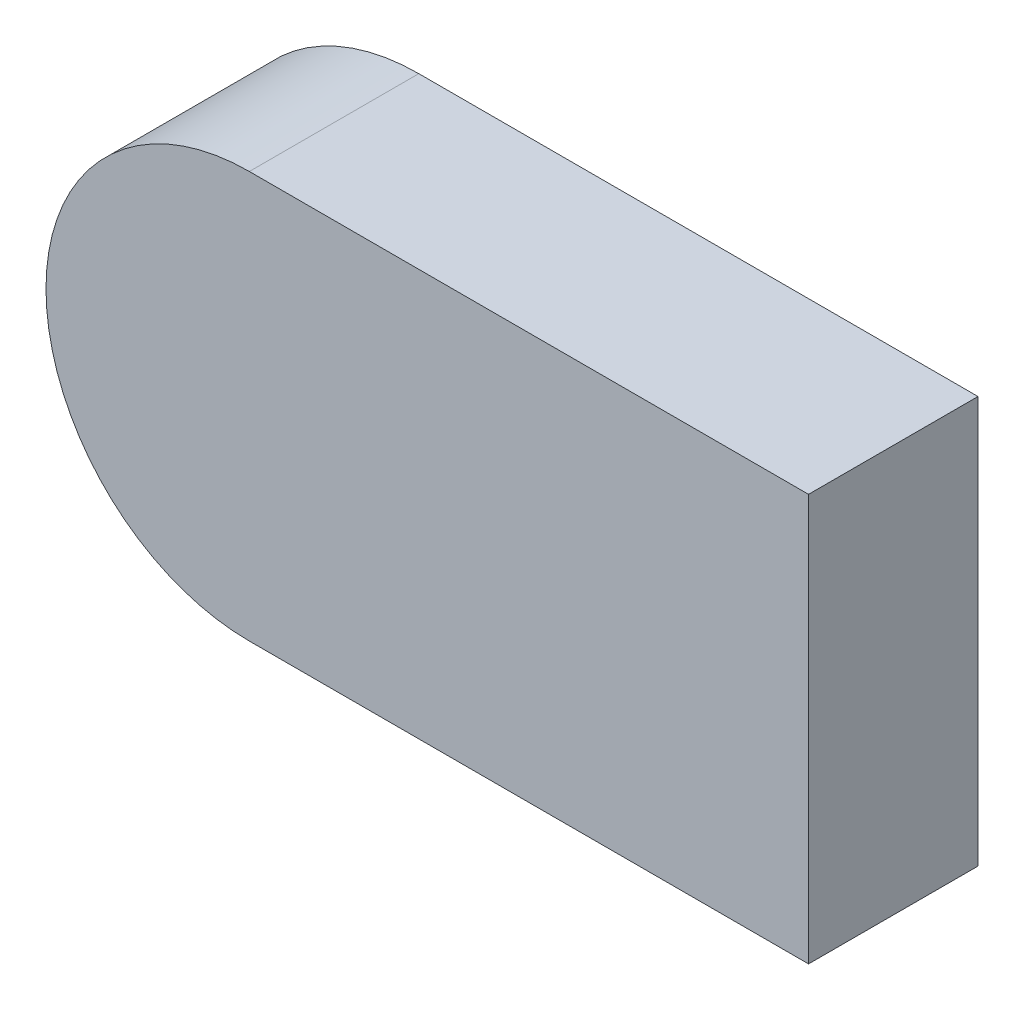
ISO-10303-21;
HEADER;
FILE_DESCRIPTION(('STEP AP214'),'2;1');
FILE_NAME('part.step','',(''),(''),'','','');
FILE_SCHEMA(('AUTOMOTIVE_DESIGN { 1 0 10303 214 1 1 1 1 }'));
ENDSEC;
DATA;
#1=APPLICATION_CONTEXT('core data for automotive mechanical design processes');
#2=APPLICATION_PROTOCOL_DEFINITION('international standard','automotive_design',2000,#1);
#3=PRODUCT_CONTEXT('',#1,'mechanical');
#4=PRODUCT('Part','Part','',(#3));
#5=PRODUCT_RELATED_PRODUCT_CATEGORY('part','',(#4));
#6=PRODUCT_DEFINITION_FORMATION('','',#4);
#7=PRODUCT_DEFINITION_CONTEXT('part definition',#1,'design');
#8=PRODUCT_DEFINITION('design','',#6,#7);
#9=PRODUCT_DEFINITION_SHAPE('','',#8);
#10=(LENGTH_UNIT() NAMED_UNIT(*) SI_UNIT(.MILLI.,.METRE.));
#11=(NAMED_UNIT(*) PLANE_ANGLE_UNIT() SI_UNIT($,.RADIAN.));
#12=(NAMED_UNIT(*) SI_UNIT($,.STERADIAN.) SOLID_ANGLE_UNIT());
#13=UNCERTAINTY_MEASURE_WITH_UNIT(LENGTH_MEASURE(1.E-05),#10,'distance_accuracy_value','');
#14=(GEOMETRIC_REPRESENTATION_CONTEXT(3) GLOBAL_UNCERTAINTY_ASSIGNED_CONTEXT((#13)) GLOBAL_UNIT_ASSIGNED_CONTEXT((#10,
#11,#12)) REPRESENTATION_CONTEXT('',''));
#15=CARTESIAN_POINT('',(0.,0.,0.));
#16=DIRECTION('',(0.,0.,1.));
#17=DIRECTION('',(1.,0.,0.));
#18=AXIS2_PLACEMENT_3D('',#15,#16,#17);
#19=CARTESIAN_POINT('',(4.05,-0.37,0.));
#20=DIRECTION('',(0.,-1.,0.));
#21=DIRECTION('',(-1.,0.,0.));
#22=AXIS2_PLACEMENT_3D('',#19,#20,#21);
#23=PLANE('',#22);
#24=DIRECTION('',(0.,0.,1.));
#25=VECTOR('',#24,1.);
#26=CARTESIAN_POINT('',(4.05,-0.37,0.));
#27=LINE('',#26,#25);
#28=CARTESIAN_POINT('',(4.05,-0.37,0.));
#29=VERTEX_POINT('',#28);
#30=CARTESIAN_POINT('',(4.05,-0.37,0.1));
#31=VERTEX_POINT('',#30);
#32=EDGE_CURVE('E11',#29,#31,#27,.T.);
#33=ORIENTED_EDGE('',*,*,#32,.T.);
#34=DIRECTION('',(-1.,0.,0.));
#35=VECTOR('',#34,1.);
#36=CARTESIAN_POINT('',(4.05,-0.37,0.1));
#37=LINE('',#36,#35);
#38=CARTESIAN_POINT('',(3.72,-0.37,0.1));
#39=VERTEX_POINT('',#38);
#40=EDGE_CURVE('E24',#31,#39,#37,.T.);
#41=ORIENTED_EDGE('',*,*,#40,.T.);
#42=DIRECTION('',(0.,0.,1.));
#43=VECTOR('',#42,1.);
#44=CARTESIAN_POINT('',(3.72,-0.37,0.));
#45=LINE('',#44,#43);
#46=CARTESIAN_POINT('',(3.72,-0.37,0.));
#47=VERTEX_POINT('',#46);
#48=EDGE_CURVE('E86',#47,#39,#45,.T.);
#49=ORIENTED_EDGE('',*,*,#48,.F.);
#50=DIRECTION('',(-1.,0.,0.));
#51=VECTOR('',#50,1.);
#52=CARTESIAN_POINT('',(4.05,-0.37,0.));
#53=LINE('',#52,#51);
#54=EDGE_CURVE('E83',#29,#47,#53,.T.);
#55=ORIENTED_EDGE('',*,*,#54,.F.);
#56=EDGE_LOOP('',(#33,#41,#49,#55));
#57=FACE_BOUND('',#56,.T.);
#58=ADVANCED_FACE('F17',(#57),#23,.T.);
#59=CARTESIAN_POINT('',(3.72,-0.25,0.));
#60=DIRECTION('',(0.,0.,-1.));
#61=DIRECTION('',(1.,0.,0.));
#62=AXIS2_PLACEMENT_3D('',#59,#60,#61);
#63=CYLINDRICAL_SURFACE('',#62,0.12);
#64=CARTESIAN_POINT('',(3.72,-0.25,0.));
#65=DIRECTION('',(0.,0.,1.));
#66=DIRECTION('',(1.,0.,0.));
#67=AXIS2_PLACEMENT_3D('',#64,#65,#66);
#68=CIRCLE('',#67,0.12);
#69=CARTESIAN_POINT('',(3.72,-0.13,0.));
#70=VERTEX_POINT('',#69);
#71=EDGE_CURVE('E80',#70,#47,#68,.T.);
#72=ORIENTED_EDGE('',*,*,#71,.T.);
#73=ORIENTED_EDGE('',*,*,#48,.T.);
#74=CARTESIAN_POINT('',(3.72,-0.25,0.1));
#75=DIRECTION('',(0.,0.,1.));
#76=DIRECTION('',(1.,0.,0.));
#77=AXIS2_PLACEMENT_3D('',#74,#75,#76);
#78=CIRCLE('',#77,0.12);
#79=CARTESIAN_POINT('',(3.72,-0.13,0.1));
#80=VERTEX_POINT('',#79);
#81=EDGE_CURVE('E78',#80,#39,#78,.T.);
#82=ORIENTED_EDGE('',*,*,#81,.F.);
#83=DIRECTION('',(0.,0.,1.));
#84=VECTOR('',#83,1.);
#85=CARTESIAN_POINT('',(3.72,-0.13,0.));
#86=LINE('',#85,#84);
#87=EDGE_CURVE('E67',#70,#80,#86,.T.);
#88=ORIENTED_EDGE('',*,*,#87,.F.);
#89=EDGE_LOOP('',(#72,#73,#82,#88));
#90=FACE_BOUND('',#89,.T.);
#91=ADVANCED_FACE('F89',(#90),#63,.T.);
#92=CARTESIAN_POINT('',(4.05,-0.13,0.));
#93=DIRECTION('',(0.,-1.,0.));
#94=DIRECTION('',(-1.,0.,0.));
#95=AXIS2_PLACEMENT_3D('',#92,#93,#94);
#96=PLANE('',#95);
#97=DIRECTION('',(-1.,0.,0.));
#98=VECTOR('',#97,1.);
#99=CARTESIAN_POINT('',(4.05,-0.13,0.));
#100=LINE('',#99,#98);
#101=CARTESIAN_POINT('',(4.05,-0.13,0.));
#102=VERTEX_POINT('',#101);
#103=EDGE_CURVE('E70',#102,#70,#100,.T.);
#104=ORIENTED_EDGE('',*,*,#103,.T.);
#105=ORIENTED_EDGE('',*,*,#87,.T.);
#106=DIRECTION('',(-1.,0.,0.));
#107=VECTOR('',#106,1.);
#108=CARTESIAN_POINT('',(4.05,-0.13,0.1));
#109=LINE('',#108,#107);
#110=CARTESIAN_POINT('',(4.05,-0.13,0.1));
#111=VERTEX_POINT('',#110);
#112=EDGE_CURVE('E61',#111,#80,#109,.T.);
#113=ORIENTED_EDGE('',*,*,#112,.F.);
#114=DIRECTION('',(0.,0.,1.));
#115=VECTOR('',#114,1.);
#116=CARTESIAN_POINT('',(4.05,-0.13,0.));
#117=LINE('',#116,#115);
#118=EDGE_CURVE('E51',#102,#111,#117,.T.);
#119=ORIENTED_EDGE('',*,*,#118,.F.);
#120=EDGE_LOOP('',(#104,#105,#113,#119));
#121=FACE_BOUND('',#120,.T.);
#122=ADVANCED_FACE('F65',(#121),#96,.F.);
#123=CARTESIAN_POINT('',(4.05,-0.37,0.));
#124=DIRECTION('',(-1.,0.,0.));
#125=DIRECTION('',(0.,1.,0.));
#126=AXIS2_PLACEMENT_3D('',#123,#124,#125);
#127=PLANE('',#126);
#128=DIRECTION('',(0.,1.,0.));
#129=VECTOR('',#128,1.);
#130=CARTESIAN_POINT('',(4.05,-0.37,0.));
#131=LINE('',#130,#129);
#132=EDGE_CURVE('E57',#29,#102,#131,.T.);
#133=ORIENTED_EDGE('',*,*,#132,.T.);
#134=ORIENTED_EDGE('',*,*,#118,.T.);
#135=DIRECTION('',(0.,1.,0.));
#136=VECTOR('',#135,1.);
#137=CARTESIAN_POINT('',(4.05,-0.37,0.1));
#138=LINE('',#137,#136);
#139=EDGE_CURVE('E55',#31,#111,#138,.T.);
#140=ORIENTED_EDGE('',*,*,#139,.F.);
#141=ORIENTED_EDGE('',*,*,#32,.F.);
#142=EDGE_LOOP('',(#133,#134,#140,#141));
#143=FACE_BOUND('',#142,.T.);
#144=ADVANCED_FACE('F53',(#143),#127,.F.);
#145=CARTESIAN_POINT('',(3.849490847913,-0.25,0.));
#146=DIRECTION('',(0.,0.,-1.));
#147=DIRECTION('',(-1.,0.,0.));
#148=AXIS2_PLACEMENT_3D('',#145,#146,#147);
#149=PLANE('',#148);
#150=ORIENTED_EDGE('',*,*,#54,.T.);
#151=ORIENTED_EDGE('',*,*,#71,.F.);
#152=ORIENTED_EDGE('',*,*,#103,.F.);
#153=ORIENTED_EDGE('',*,*,#132,.F.);
#154=EDGE_LOOP('',(#150,#151,#152,#153));
#155=FACE_BOUND('',#154,.T.);
#156=ADVANCED_FACE('F91',(#155),#149,.T.);
#157=CARTESIAN_POINT('',(3.849490847913,-0.25,0.1));
#158=DIRECTION('',(0.,0.,-1.));
#159=DIRECTION('',(-1.,0.,0.));
#160=AXIS2_PLACEMENT_3D('',#157,#158,#159);
#161=PLANE('',#160);
#162=ORIENTED_EDGE('',*,*,#139,.T.);
#163=ORIENTED_EDGE('',*,*,#112,.T.);
#164=ORIENTED_EDGE('',*,*,#81,.T.);
#165=ORIENTED_EDGE('',*,*,#40,.F.);
#166=EDGE_LOOP('',(#162,#163,#164,#165));
#167=FACE_BOUND('',#166,.T.);
#168=ADVANCED_FACE('F72',(#167),#161,.F.);
#169=CLOSED_SHELL('',(#58,#91,#122,#144,#156,#168));
#170=MANIFOLD_SOLID_BREP('B1',#169);
#171=ADVANCED_BREP_SHAPE_REPRESENTATION('',(#18,#170),#14);
#172=SHAPE_DEFINITION_REPRESENTATION(#9,#171);
ENDSEC;
END-ISO-10303-21;
